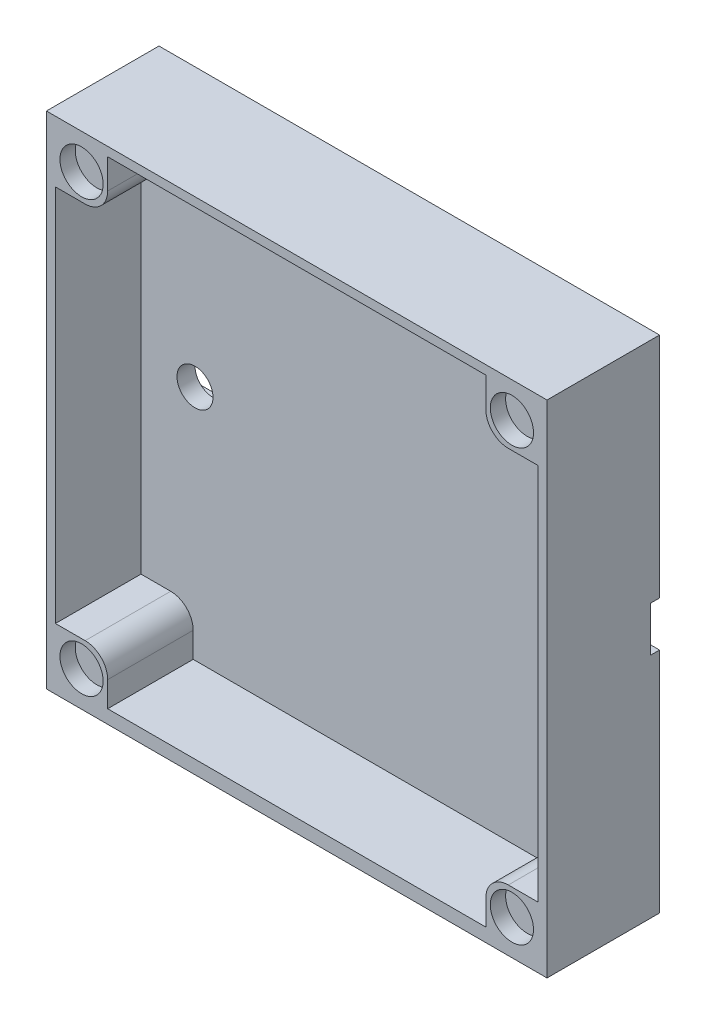
ISO-10303-21;
HEADER;
FILE_DESCRIPTION(('STEP AP214'),'2;1');
FILE_NAME('part.step','',(''),(''),'','','');
FILE_SCHEMA(('AUTOMOTIVE_DESIGN { 1 0 10303 214 1 1 1 1 }'));
ENDSEC;
DATA;
#1=APPLICATION_CONTEXT('core data for automotive mechanical design processes');
#2=APPLICATION_PROTOCOL_DEFINITION('international standard','automotive_design',2000,#1);
#3=PRODUCT_CONTEXT('',#1,'mechanical');
#4=PRODUCT('Part','Part','',(#3));
#5=PRODUCT_RELATED_PRODUCT_CATEGORY('part','',(#4));
#6=PRODUCT_DEFINITION_FORMATION('','',#4);
#7=PRODUCT_DEFINITION_CONTEXT('part definition',#1,'design');
#8=PRODUCT_DEFINITION('design','',#6,#7);
#9=PRODUCT_DEFINITION_SHAPE('','',#8);
#10=(LENGTH_UNIT() NAMED_UNIT(*) SI_UNIT(.MILLI.,.METRE.));
#11=(NAMED_UNIT(*) PLANE_ANGLE_UNIT() SI_UNIT($,.RADIAN.));
#12=(NAMED_UNIT(*) SI_UNIT($,.STERADIAN.) SOLID_ANGLE_UNIT());
#13=UNCERTAINTY_MEASURE_WITH_UNIT(LENGTH_MEASURE(1.E-05),#10,'distance_accuracy_value','');
#14=(GEOMETRIC_REPRESENTATION_CONTEXT(3) GLOBAL_UNCERTAINTY_ASSIGNED_CONTEXT((#13)) GLOBAL_UNIT_ASSIGNED_CONTEXT((#10,
#11,#12)) REPRESENTATION_CONTEXT('',''));
#15=CARTESIAN_POINT('',(0.,0.,0.));
#16=DIRECTION('',(0.,0.,1.));
#17=DIRECTION('',(1.,0.,0.));
#18=AXIS2_PLACEMENT_3D('',#15,#16,#17);
#19=CARTESIAN_POINT('',(27.8,27.8,3.));
#20=DIRECTION('',(1.,0.,0.));
#21=DIRECTION('',(0.,1.,0.));
#22=AXIS2_PLACEMENT_3D('',#19,#20,#21);
#23=PLANE('',#22);
#24=DIRECTION('',(0.,0.,-1.));
#25=VECTOR('',#24,1.);
#26=CARTESIAN_POINT('',(27.8,27.8,3.));
#27=LINE('',#26,#25);
#28=CARTESIAN_POINT('',(27.8,27.8,12.5));
#29=VERTEX_POINT('',#28);
#30=CARTESIAN_POINT('',(27.8,27.8,0.));
#31=VERTEX_POINT('',#30);
#32=EDGE_CURVE('E371',#29,#31,#27,.T.);
#33=ORIENTED_EDGE('',*,*,#32,.F.);
#34=DIRECTION('',(0.,1.,0.));
#35=VECTOR('',#34,1.);
#36=CARTESIAN_POINT('',(27.8,0.,12.5));
#37=LINE('',#36,#35);
#38=CARTESIAN_POINT('',(27.8,-27.8,12.5));
#39=VERTEX_POINT('',#38);
#40=EDGE_CURVE('E312',#39,#29,#37,.T.);
#41=ORIENTED_EDGE('',*,*,#40,.F.);
#42=DIRECTION('',(0.,0.,-1.));
#43=VECTOR('',#42,1.);
#44=CARTESIAN_POINT('',(27.8,-27.8,3.));
#45=LINE('',#44,#43);
#46=CARTESIAN_POINT('',(27.8,-27.8,0.));
#47=VERTEX_POINT('',#46);
#48=EDGE_CURVE('E367',#39,#47,#45,.T.);
#49=ORIENTED_EDGE('',*,*,#48,.T.);
#50=DIRECTION('',(0.,-1.,0.));
#51=VECTOR('',#50,1.);
#52=CARTESIAN_POINT('',(27.8,27.8,0.));
#53=LINE('',#52,#51);
#54=CARTESIAN_POINT('',(27.8,-2.5,0.));
#55=VERTEX_POINT('',#54);
#56=EDGE_CURVE('E363',#55,#47,#53,.T.);
#57=ORIENTED_EDGE('',*,*,#56,.F.);
#58=DIRECTION('',(0.,0.,-1.));
#59=VECTOR('',#58,1.);
#60=CARTESIAN_POINT('',(27.8,-2.5,1.));
#61=LINE('',#60,#59);
#62=CARTESIAN_POINT('',(27.8,-2.5,1.));
#63=VERTEX_POINT('',#62);
#64=EDGE_CURVE('E342',#63,#55,#61,.T.);
#65=ORIENTED_EDGE('',*,*,#64,.F.);
#66=DIRECTION('',(0.,-1.,0.));
#67=VECTOR('',#66,1.);
#68=CARTESIAN_POINT('',(27.8,2.5,1.));
#69=LINE('',#68,#67);
#70=CARTESIAN_POINT('',(27.8,2.5,1.));
#71=VERTEX_POINT('',#70);
#72=EDGE_CURVE('E330',#71,#63,#69,.T.);
#73=ORIENTED_EDGE('',*,*,#72,.F.);
#74=DIRECTION('',(0.,0.,-1.));
#75=VECTOR('',#74,1.);
#76=CARTESIAN_POINT('',(27.8,2.5,1.));
#77=LINE('',#76,#75);
#78=CARTESIAN_POINT('',(27.8,2.5,0.));
#79=VERTEX_POINT('',#78);
#80=EDGE_CURVE('E346',#71,#79,#77,.T.);
#81=ORIENTED_EDGE('',*,*,#80,.T.);
#82=EDGE_CURVE('E364',#31,#79,#53,.T.);
#83=ORIENTED_EDGE('',*,*,#82,.F.);
#84=EDGE_LOOP('',(#33,#41,#49,#57,#65,#73,#81,#83));
#85=FACE_BOUND('',#84,.T.);
#86=ADVANCED_FACE('F71',(#85),#23,.T.);
#87=CARTESIAN_POINT('',(-27.8,27.8,3.));
#88=DIRECTION('',(1.,0.,0.));
#89=DIRECTION('',(0.,1.,0.));
#90=AXIS2_PLACEMENT_3D('',#87,#88,#89);
#91=PLANE('',#90);
#92=DIRECTION('',(0.,-1.,0.));
#93=VECTOR('',#92,1.);
#94=CARTESIAN_POINT('',(-27.8,27.8,0.));
#95=LINE('',#94,#93);
#96=CARTESIAN_POINT('',(-27.8,-2.5,0.));
#97=VERTEX_POINT('',#96);
#98=CARTESIAN_POINT('',(-27.8,-27.8,0.));
#99=VERTEX_POINT('',#98);
#100=EDGE_CURVE('E358',#97,#99,#95,.T.);
#101=ORIENTED_EDGE('',*,*,#100,.T.);
#102=DIRECTION('',(0.,0.,-1.));
#103=VECTOR('',#102,1.);
#104=CARTESIAN_POINT('',(-27.8,-27.8,3.));
#105=LINE('',#104,#103);
#106=CARTESIAN_POINT('',(-27.8,-27.8,12.5));
#107=VERTEX_POINT('',#106);
#108=EDGE_CURVE('E366',#107,#99,#105,.T.);
#109=ORIENTED_EDGE('',*,*,#108,.F.);
#110=DIRECTION('',(0.,-1.,0.));
#111=VECTOR('',#110,1.);
#112=CARTESIAN_POINT('',(-27.8,0.,12.5));
#113=LINE('',#112,#111);
#114=CARTESIAN_POINT('',(-27.8,27.8,12.5));
#115=VERTEX_POINT('',#114);
#116=EDGE_CURVE('E316',#115,#107,#113,.T.);
#117=ORIENTED_EDGE('',*,*,#116,.F.);
#118=DIRECTION('',(0.,0.,-1.));
#119=VECTOR('',#118,1.);
#120=CARTESIAN_POINT('',(-27.8,27.8,3.));
#121=LINE('',#120,#119);
#122=CARTESIAN_POINT('',(-27.8,27.8,0.));
#123=VERTEX_POINT('',#122);
#124=EDGE_CURVE('E373',#115,#123,#121,.T.);
#125=ORIENTED_EDGE('',*,*,#124,.T.);
#126=CARTESIAN_POINT('',(-27.8,2.5,0.));
#127=VERTEX_POINT('',#126);
#128=EDGE_CURVE('E359',#123,#127,#95,.T.);
#129=ORIENTED_EDGE('',*,*,#128,.T.);
#130=DIRECTION('',(0.,0.,-1.));
#131=VECTOR('',#130,1.);
#132=CARTESIAN_POINT('',(-27.8,2.5,1.));
#133=LINE('',#132,#131);
#134=CARTESIAN_POINT('',(-27.8,2.5,1.));
#135=VERTEX_POINT('',#134);
#136=EDGE_CURVE('E350',#135,#127,#133,.T.);
#137=ORIENTED_EDGE('',*,*,#136,.F.);
#138=DIRECTION('',(0.,-1.,0.));
#139=VECTOR('',#138,1.);
#140=CARTESIAN_POINT('',(-27.8,2.5,1.));
#141=LINE('',#140,#139);
#142=CARTESIAN_POINT('',(-27.8,-2.5,1.));
#143=VERTEX_POINT('',#142);
#144=EDGE_CURVE('E337',#135,#143,#141,.T.);
#145=ORIENTED_EDGE('',*,*,#144,.T.);
#146=DIRECTION('',(0.,0.,-1.));
#147=VECTOR('',#146,1.);
#148=CARTESIAN_POINT('',(-27.8,-2.5,1.));
#149=LINE('',#148,#147);
#150=EDGE_CURVE('E353',#143,#97,#149,.T.);
#151=ORIENTED_EDGE('',*,*,#150,.T.);
#152=EDGE_LOOP('',(#101,#109,#117,#125,#129,#137,#145,#151));
#153=FACE_BOUND('',#152,.T.);
#154=ADVANCED_FACE('F494',(#153),#91,.F.);
#155=CARTESIAN_POINT('',(0.,0.,0.));
#156=DIRECTION('',(0.,0.,1.));
#157=DIRECTION('',(1.,0.,0.));
#158=AXIS2_PLACEMENT_3D('',#155,#156,#157);
#159=PLANE('',#158);
#160=DIRECTION('',(-1.,0.,0.));
#161=VECTOR('',#160,1.);
#162=CARTESIAN_POINT('',(27.8,2.5,0.));
#163=LINE('',#162,#161);
#164=EDGE_CURVE('E334',#79,#127,#163,.T.);
#165=ORIENTED_EDGE('',*,*,#164,.T.);
#166=ORIENTED_EDGE('',*,*,#128,.F.);
#167=DIRECTION('',(-1.,0.,0.));
#168=VECTOR('',#167,1.);
#169=CARTESIAN_POINT('',(27.8,27.8,0.));
#170=LINE('',#169,#168);
#171=EDGE_CURVE('E361',#31,#123,#170,.T.);
#172=ORIENTED_EDGE('',*,*,#171,.F.);
#173=ORIENTED_EDGE('',*,*,#82,.T.);
#174=EDGE_LOOP('',(#165,#166,#172,#173));
#175=FACE_BOUND('',#174,.T.);
#176=ADVANCED_FACE('F500',(#175),#159,.F.);
#177=CARTESIAN_POINT('',(27.8,-27.8,3.));
#178=DIRECTION('',(0.,-1.,0.));
#179=DIRECTION('',(1.,0.,0.));
#180=AXIS2_PLACEMENT_3D('',#177,#178,#179);
#181=PLANE('',#180);
#182=ORIENTED_EDGE('',*,*,#48,.F.);
#183=DIRECTION('',(1.,0.,0.));
#184=VECTOR('',#183,1.);
#185=CARTESIAN_POINT('',(0.,-27.8,12.5));
#186=LINE('',#185,#184);
#187=EDGE_CURVE('E310',#107,#39,#186,.T.);
#188=ORIENTED_EDGE('',*,*,#187,.F.);
#189=ORIENTED_EDGE('',*,*,#108,.T.);
#190=DIRECTION('',(-1.,0.,0.));
#191=VECTOR('',#190,1.);
#192=CARTESIAN_POINT('',(27.8,-27.8,0.));
#193=LINE('',#192,#191);
#194=EDGE_CURVE('E349',#47,#99,#193,.T.);
#195=ORIENTED_EDGE('',*,*,#194,.F.);
#196=EDGE_LOOP('',(#182,#188,#189,#195));
#197=FACE_BOUND('',#196,.T.);
#198=ADVANCED_FACE('F510',(#197),#181,.T.);
#199=CARTESIAN_POINT('',(27.8,27.8,3.));
#200=DIRECTION('',(0.,-1.,0.));
#201=DIRECTION('',(1.,0.,0.));
#202=AXIS2_PLACEMENT_3D('',#199,#200,#201);
#203=PLANE('',#202);
#204=ORIENTED_EDGE('',*,*,#171,.T.);
#205=ORIENTED_EDGE('',*,*,#124,.F.);
#206=DIRECTION('',(-1.,0.,0.));
#207=VECTOR('',#206,1.);
#208=CARTESIAN_POINT('',(0.,27.8,12.5));
#209=LINE('',#208,#207);
#210=EDGE_CURVE('E314',#29,#115,#209,.T.);
#211=ORIENTED_EDGE('',*,*,#210,.F.);
#212=ORIENTED_EDGE('',*,*,#32,.T.);
#213=EDGE_LOOP('',(#204,#205,#211,#212));
#214=FACE_BOUND('',#213,.T.);
#215=ADVANCED_FACE('F508',(#214),#203,.F.);
#216=ORIENTED_EDGE('',*,*,#194,.T.);
#217=ORIENTED_EDGE('',*,*,#100,.F.);
#218=DIRECTION('',(-1.,0.,0.));
#219=VECTOR('',#218,1.);
#220=CARTESIAN_POINT('',(27.8,-2.5,0.));
#221=LINE('',#220,#219);
#222=EDGE_CURVE('E319',#55,#97,#221,.T.);
#223=ORIENTED_EDGE('',*,*,#222,.F.);
#224=ORIENTED_EDGE('',*,*,#56,.T.);
#225=EDGE_LOOP('',(#216,#217,#223,#224));
#226=FACE_BOUND('',#225,.T.);
#227=ADVANCED_FACE('F506',(#226),#159,.F.);
#228=CARTESIAN_POINT('',(27.8,2.5,1.));
#229=DIRECTION('',(0.,-1.,0.));
#230=DIRECTION('',(0.,0.,-1.));
#231=AXIS2_PLACEMENT_3D('',#228,#229,#230);
#232=PLANE('',#231);
#233=ORIENTED_EDGE('',*,*,#164,.F.);
#234=ORIENTED_EDGE('',*,*,#80,.F.);
#235=DIRECTION('',(-1.,0.,0.));
#236=VECTOR('',#235,1.);
#237=CARTESIAN_POINT('',(27.8,2.5,1.));
#238=LINE('',#237,#236);
#239=EDGE_CURVE('E340',#71,#135,#238,.T.);
#240=ORIENTED_EDGE('',*,*,#239,.T.);
#241=ORIENTED_EDGE('',*,*,#136,.T.);
#242=EDGE_LOOP('',(#233,#234,#240,#241));
#243=FACE_BOUND('',#242,.T.);
#244=ADVANCED_FACE('F581',(#243),#232,.T.);
#245=CARTESIAN_POINT('',(27.8,-2.5,1.));
#246=DIRECTION('',(0.,-1.,0.));
#247=DIRECTION('',(0.,0.,-1.));
#248=AXIS2_PLACEMENT_3D('',#245,#246,#247);
#249=PLANE('',#248);
#250=ORIENTED_EDGE('',*,*,#222,.T.);
#251=ORIENTED_EDGE('',*,*,#150,.F.);
#252=DIRECTION('',(-1.,0.,0.));
#253=VECTOR('',#252,1.);
#254=CARTESIAN_POINT('',(27.8,-2.5,1.));
#255=LINE('',#254,#253);
#256=EDGE_CURVE('E333',#63,#143,#255,.T.);
#257=ORIENTED_EDGE('',*,*,#256,.F.);
#258=ORIENTED_EDGE('',*,*,#64,.T.);
#259=EDGE_LOOP('',(#250,#251,#257,#258));
#260=FACE_BOUND('',#259,.T.);
#261=ADVANCED_FACE('F576',(#260),#249,.F.);
#262=CARTESIAN_POINT('',(0.,0.,1.));
#263=DIRECTION('',(0.,0.,-1.));
#264=DIRECTION('',(-1.,0.,0.));
#265=AXIS2_PLACEMENT_3D('',#262,#263,#264);
#266=PLANE('',#265);
#267=CARTESIAN_POINT('',(20.8,0.,1.));
#268=DIRECTION('',(0.,0.,-1.));
#269=DIRECTION('',(-1.,0.,0.));
#270=AXIS2_PLACEMENT_3D('',#267,#268,#269);
#271=CIRCLE('',#270,2.);
#272=CARTESIAN_POINT('',(18.8,0.,1.));
#273=VERTEX_POINT('',#272);
#274=EDGE_CURVE('E299',#273,#273,#271,.T.);
#275=ORIENTED_EDGE('',*,*,#274,.F.);
#276=EDGE_LOOP('',(#275));
#277=FACE_BOUND('',#276,.T.);
#278=CARTESIAN_POINT('',(-20.8,0.,1.));
#279=DIRECTION('',(0.,0.,-1.));
#280=DIRECTION('',(-1.,0.,0.));
#281=AXIS2_PLACEMENT_3D('',#278,#279,#280);
#282=CIRCLE('',#281,2.);
#283=CARTESIAN_POINT('',(-22.8,0.,1.));
#284=VERTEX_POINT('',#283);
#285=EDGE_CURVE('E298',#284,#284,#282,.T.);
#286=ORIENTED_EDGE('',*,*,#285,.F.);
#287=EDGE_LOOP('',(#286));
#288=FACE_BOUND('',#287,.T.);
#289=ORIENTED_EDGE('',*,*,#72,.T.);
#290=ORIENTED_EDGE('',*,*,#256,.T.);
#291=ORIENTED_EDGE('',*,*,#144,.F.);
#292=ORIENTED_EDGE('',*,*,#239,.F.);
#293=EDGE_LOOP('',(#289,#290,#291,#292));
#294=FACE_BOUND('',#293,.T.);
#295=ADVANCED_FACE('F566',(#277,#288,#294),#266,.T.);
#296=CARTESIAN_POINT('',(26.8,0.,12.5));
#297=DIRECTION('',(1.,0.,0.));
#298=DIRECTION('',(0.,1.,0.));
#299=AXIS2_PLACEMENT_3D('',#296,#297,#298);
#300=PLANE('',#299);
#301=DIRECTION('',(0.,-1.,0.));
#302=VECTOR('',#301,1.);
#303=CARTESIAN_POINT('',(26.8,0.,3.));
#304=LINE('',#303,#302);
#305=CARTESIAN_POINT('',(26.8,21.,3.));
#306=VERTEX_POINT('',#305);
#307=CARTESIAN_POINT('',(26.8,-21.,3.));
#308=VERTEX_POINT('',#307);
#309=EDGE_CURVE('E252',#306,#308,#304,.T.);
#310=ORIENTED_EDGE('',*,*,#309,.T.);
#311=DIRECTION('',(0.,0.,1.));
#312=VECTOR('',#311,1.);
#313=CARTESIAN_POINT('',(26.8,-21.,12.5));
#314=LINE('',#313,#312);
#315=CARTESIAN_POINT('',(26.8,-21.,12.5));
#316=VERTEX_POINT('',#315);
#317=EDGE_CURVE('E274',#308,#316,#314,.T.);
#318=ORIENTED_EDGE('',*,*,#317,.T.);
#319=DIRECTION('',(0.,-1.,0.));
#320=VECTOR('',#319,1.);
#321=CARTESIAN_POINT('',(26.8,0.,12.5));
#322=LINE('',#321,#320);
#323=CARTESIAN_POINT('',(26.8,21.,12.5));
#324=VERTEX_POINT('',#323);
#325=EDGE_CURVE('E307',#324,#316,#322,.T.);
#326=ORIENTED_EDGE('',*,*,#325,.F.);
#327=DIRECTION('',(0.,0.,-1.));
#328=VECTOR('',#327,1.);
#329=CARTESIAN_POINT('',(26.8,21.,12.5));
#330=LINE('',#329,#328);
#331=EDGE_CURVE('E292',#324,#306,#330,.T.);
#332=ORIENTED_EDGE('',*,*,#331,.T.);
#333=EDGE_LOOP('',(#310,#318,#326,#332));
#334=FACE_BOUND('',#333,.T.);
#335=ADVANCED_FACE('F552',(#334),#300,.F.);
#336=CARTESIAN_POINT('',(-26.8,0.,12.5));
#337=DIRECTION('',(1.,0.,0.));
#338=DIRECTION('',(0.,1.,0.));
#339=AXIS2_PLACEMENT_3D('',#336,#337,#338);
#340=PLANE('',#339);
#341=DIRECTION('',(0.,0.,1.));
#342=VECTOR('',#341,1.);
#343=CARTESIAN_POINT('',(-26.8,-21.,12.5));
#344=LINE('',#343,#342);
#345=CARTESIAN_POINT('',(-26.8,-21.,3.));
#346=VERTEX_POINT('',#345);
#347=CARTESIAN_POINT('',(-26.8,-21.,12.5));
#348=VERTEX_POINT('',#347);
#349=EDGE_CURVE('E236',#346,#348,#344,.T.);
#350=ORIENTED_EDGE('',*,*,#349,.F.);
#351=DIRECTION('',(0.,-1.,0.));
#352=VECTOR('',#351,1.);
#353=CARTESIAN_POINT('',(-26.8,0.,3.));
#354=LINE('',#353,#352);
#355=CARTESIAN_POINT('',(-26.8,21.,3.));
#356=VERTEX_POINT('',#355);
#357=EDGE_CURVE('E244',#356,#346,#354,.T.);
#358=ORIENTED_EDGE('',*,*,#357,.F.);
#359=DIRECTION('',(0.,0.,-1.));
#360=VECTOR('',#359,1.);
#361=CARTESIAN_POINT('',(-26.8,21.,12.5));
#362=LINE('',#361,#360);
#363=CARTESIAN_POINT('',(-26.8,21.,12.5));
#364=VERTEX_POINT('',#363);
#365=EDGE_CURVE('E285',#364,#356,#362,.T.);
#366=ORIENTED_EDGE('',*,*,#365,.F.);
#367=DIRECTION('',(0.,-1.,0.));
#368=VECTOR('',#367,1.);
#369=CARTESIAN_POINT('',(-26.8,0.,12.5));
#370=LINE('',#369,#368);
#371=EDGE_CURVE('E256',#364,#348,#370,.T.);
#372=ORIENTED_EDGE('',*,*,#371,.T.);
#373=EDGE_LOOP('',(#350,#358,#366,#372));
#374=FACE_BOUND('',#373,.T.);
#375=ADVANCED_FACE('F254',(#374),#340,.T.);
#376=CARTESIAN_POINT('',(0.,26.8,12.5));
#377=DIRECTION('',(0.,1.,0.));
#378=DIRECTION('',(0.,0.,1.));
#379=AXIS2_PLACEMENT_3D('',#376,#377,#378);
#380=PLANE('',#379);
#381=DIRECTION('',(1.,0.,0.));
#382=VECTOR('',#381,1.);
#383=CARTESIAN_POINT('',(0.,26.8,12.5));
#384=LINE('',#383,#382);
#385=CARTESIAN_POINT('',(-21.,26.8,12.5));
#386=VERTEX_POINT('',#385);
#387=CARTESIAN_POINT('',(21.,26.8,12.5));
#388=VERTEX_POINT('',#387);
#389=EDGE_CURVE('E251',#386,#388,#384,.T.);
#390=ORIENTED_EDGE('',*,*,#389,.F.);
#391=DIRECTION('',(0.,0.,-1.));
#392=VECTOR('',#391,1.);
#393=CARTESIAN_POINT('',(-21.,26.8,12.5));
#394=LINE('',#393,#392);
#395=CARTESIAN_POINT('',(-21.,26.8,3.));
#396=VERTEX_POINT('',#395);
#397=EDGE_CURVE('E282',#386,#396,#394,.T.);
#398=ORIENTED_EDGE('',*,*,#397,.T.);
#399=DIRECTION('',(1.,0.,0.));
#400=VECTOR('',#399,1.);
#401=CARTESIAN_POINT('',(0.,26.8,3.));
#402=LINE('',#401,#400);
#403=CARTESIAN_POINT('',(21.,26.8,3.));
#404=VERTEX_POINT('',#403);
#405=EDGE_CURVE('E320',#396,#404,#402,.T.);
#406=ORIENTED_EDGE('',*,*,#405,.T.);
#407=DIRECTION('',(0.,0.,1.));
#408=VECTOR('',#407,1.);
#409=CARTESIAN_POINT('',(21.,26.8,12.5));
#410=LINE('',#409,#408);
#411=EDGE_CURVE('E295',#404,#388,#410,.T.);
#412=ORIENTED_EDGE('',*,*,#411,.T.);
#413=EDGE_LOOP('',(#390,#398,#406,#412));
#414=FACE_BOUND('',#413,.T.);
#415=ADVANCED_FACE('F475',(#414),#380,.F.);
#416=CARTESIAN_POINT('',(0.,0.,12.5));
#417=DIRECTION('',(0.,0.,1.));
#418=DIRECTION('',(1.,0.,0.));
#419=AXIS2_PLACEMENT_3D('',#416,#417,#418);
#420=PLANE('',#419);
#421=CARTESIAN_POINT('',(23.9002805646626,-23.9,12.5));
#422=DIRECTION('',(0.,0.,1.));
#423=DIRECTION('',(1.,0.,0.));
#424=AXIS2_PLACEMENT_3D('',#421,#422,#423);
#425=CIRCLE('',#424,2.4);
#426=CARTESIAN_POINT('',(26.3002805646626,-23.9,12.5));
#427=VERTEX_POINT('',#426);
#428=EDGE_CURVE('E445',#427,#427,#425,.T.);
#429=ORIENTED_EDGE('',*,*,#428,.F.);
#430=EDGE_LOOP('',(#429));
#431=FACE_BOUND('',#430,.T.);
#432=CARTESIAN_POINT('',(23.9002805646626,23.9,12.5));
#433=DIRECTION('',(0.,0.,1.));
#434=DIRECTION('',(1.,0.,0.));
#435=AXIS2_PLACEMENT_3D('',#432,#433,#434);
#436=CIRCLE('',#435,2.4);
#437=CARTESIAN_POINT('',(26.3002805646626,23.9,12.5));
#438=VERTEX_POINT('',#437);
#439=EDGE_CURVE('E451',#438,#438,#436,.T.);
#440=ORIENTED_EDGE('',*,*,#439,.F.);
#441=EDGE_LOOP('',(#440));
#442=FACE_BOUND('',#441,.T.);
#443=CARTESIAN_POINT('',(-23.9,23.9,12.5));
#444=DIRECTION('',(0.,0.,1.));
#445=DIRECTION('',(1.,0.,0.));
#446=AXIS2_PLACEMENT_3D('',#443,#444,#445);
#447=CIRCLE('',#446,2.4);
#448=CARTESIAN_POINT('',(-21.5,23.9,12.5));
#449=VERTEX_POINT('',#448);
#450=EDGE_CURVE('E457',#449,#449,#447,.T.);
#451=ORIENTED_EDGE('',*,*,#450,.F.);
#452=EDGE_LOOP('',(#451));
#453=FACE_BOUND('',#452,.T.);
#454=CARTESIAN_POINT('',(-23.9,-23.9,12.5));
#455=DIRECTION('',(0.,0.,1.));
#456=DIRECTION('',(1.,0.,0.));
#457=AXIS2_PLACEMENT_3D('',#454,#455,#456);
#458=CIRCLE('',#457,2.4);
#459=CARTESIAN_POINT('',(-21.5,-23.9,12.5));
#460=VERTEX_POINT('',#459);
#461=EDGE_CURVE('E439',#460,#460,#458,.T.);
#462=ORIENTED_EDGE('',*,*,#461,.F.);
#463=EDGE_LOOP('',(#462));
#464=FACE_BOUND('',#463,.T.);
#465=DIRECTION('',(0.,1.,0.));
#466=VECTOR('',#465,1.);
#467=CARTESIAN_POINT('',(21.,27.8,12.5));
#468=LINE('',#467,#466);
#469=CARTESIAN_POINT('',(21.,23.5,12.5));
#470=VERTEX_POINT('',#469);
#471=EDGE_CURVE('E290',#470,#388,#468,.T.);
#472=ORIENTED_EDGE('',*,*,#471,.F.);
#473=CARTESIAN_POINT('',(23.5,23.5,12.5));
#474=DIRECTION('',(0.,0.,1.));
#475=DIRECTION('',(1.,0.,0.));
#476=AXIS2_PLACEMENT_3D('',#473,#474,#475);
#477=CIRCLE('',#476,2.5);
#478=CARTESIAN_POINT('',(23.5,21.,12.5));
#479=VERTEX_POINT('',#478);
#480=EDGE_CURVE('E406',#470,#479,#477,.T.);
#481=ORIENTED_EDGE('',*,*,#480,.T.);
#482=DIRECTION('',(-1.,0.,0.));
#483=VECTOR('',#482,1.);
#484=CARTESIAN_POINT('',(27.8,21.,12.5));
#485=LINE('',#484,#483);
#486=EDGE_CURVE('E287',#324,#479,#485,.T.);
#487=ORIENTED_EDGE('',*,*,#486,.F.);
#488=ORIENTED_EDGE('',*,*,#325,.T.);
#489=DIRECTION('',(1.,0.,0.));
#490=VECTOR('',#489,1.);
#491=CARTESIAN_POINT('',(27.8,-21.,12.5));
#492=LINE('',#491,#490);
#493=CARTESIAN_POINT('',(23.5,-21.,12.5));
#494=VERTEX_POINT('',#493);
#495=EDGE_CURVE('E269',#494,#316,#492,.T.);
#496=ORIENTED_EDGE('',*,*,#495,.F.);
#497=CARTESIAN_POINT('',(23.5,-23.5,12.5));
#498=DIRECTION('',(0.,0.,1.));
#499=DIRECTION('',(1.,0.,0.));
#500=AXIS2_PLACEMENT_3D('',#497,#498,#499);
#501=CIRCLE('',#500,2.5);
#502=CARTESIAN_POINT('',(21.,-23.5,12.5));
#503=VERTEX_POINT('',#502);
#504=EDGE_CURVE('E404',#494,#503,#501,.T.);
#505=ORIENTED_EDGE('',*,*,#504,.T.);
#506=DIRECTION('',(0.,1.,0.));
#507=VECTOR('',#506,1.);
#508=CARTESIAN_POINT('',(21.,-27.8,12.5));
#509=LINE('',#508,#507);
#510=CARTESIAN_POINT('',(21.,-26.3,12.5));
#511=VERTEX_POINT('',#510);
#512=EDGE_CURVE('E261',#511,#503,#509,.T.);
#513=ORIENTED_EDGE('',*,*,#512,.F.);
#514=DIRECTION('',(1.,0.,0.));
#515=VECTOR('',#514,1.);
#516=CARTESIAN_POINT('',(-26.8,-26.3,12.5));
#517=LINE('',#516,#515);
#518=CARTESIAN_POINT('',(-21.,-26.3,12.5));
#519=VERTEX_POINT('',#518);
#520=EDGE_CURVE('E322',#519,#511,#517,.T.);
#521=ORIENTED_EDGE('',*,*,#520,.F.);
#522=DIRECTION('',(0.,-1.,0.));
#523=VECTOR('',#522,1.);
#524=CARTESIAN_POINT('',(-21.,-27.8,12.5));
#525=LINE('',#524,#523);
#526=CARTESIAN_POINT('',(-21.,-23.5,12.5));
#527=VERTEX_POINT('',#526);
#528=EDGE_CURVE('E258',#527,#519,#525,.T.);
#529=ORIENTED_EDGE('',*,*,#528,.F.);
#530=CARTESIAN_POINT('',(-23.5,-23.5,12.5));
#531=DIRECTION('',(0.,0.,1.));
#532=DIRECTION('',(1.,0.,0.));
#533=AXIS2_PLACEMENT_3D('',#530,#531,#532);
#534=CIRCLE('',#533,2.5);
#535=CARTESIAN_POINT('',(-23.5,-21.,12.5));
#536=VERTEX_POINT('',#535);
#537=EDGE_CURVE('E402',#527,#536,#534,.T.);
#538=ORIENTED_EDGE('',*,*,#537,.T.);
#539=DIRECTION('',(1.,0.,0.));
#540=VECTOR('',#539,1.);
#541=CARTESIAN_POINT('',(-27.8,-21.,12.5));
#542=LINE('',#541,#540);
#543=EDGE_CURVE('E263',#348,#536,#542,.T.);
#544=ORIENTED_EDGE('',*,*,#543,.F.);
#545=ORIENTED_EDGE('',*,*,#371,.F.);
#546=DIRECTION('',(-1.,0.,0.));
#547=VECTOR('',#546,1.);
#548=CARTESIAN_POINT('',(-27.8,21.,12.5));
#549=LINE('',#548,#547);
#550=CARTESIAN_POINT('',(-23.5,21.,12.5));
#551=VERTEX_POINT('',#550);
#552=EDGE_CURVE('E280',#551,#364,#549,.T.);
#553=ORIENTED_EDGE('',*,*,#552,.F.);
#554=CARTESIAN_POINT('',(-23.5,23.5,12.5));
#555=DIRECTION('',(0.,0.,1.));
#556=DIRECTION('',(1.,0.,0.));
#557=AXIS2_PLACEMENT_3D('',#554,#555,#556);
#558=CIRCLE('',#557,2.5);
#559=CARTESIAN_POINT('',(-21.,23.5,12.5));
#560=VERTEX_POINT('',#559);
#561=EDGE_CURVE('E400',#551,#560,#558,.T.);
#562=ORIENTED_EDGE('',*,*,#561,.T.);
#563=DIRECTION('',(0.,-1.,0.));
#564=VECTOR('',#563,1.);
#565=CARTESIAN_POINT('',(-21.,27.8,12.5));
#566=LINE('',#565,#564);
#567=EDGE_CURVE('E277',#386,#560,#566,.T.);
#568=ORIENTED_EDGE('',*,*,#567,.F.);
#569=ORIENTED_EDGE('',*,*,#389,.T.);
#570=EDGE_LOOP('',(#472,#481,#487,#488,#496,#505,#513,#521,#529,#538,#544,#545,#553,#562,#568,#569));
#571=FACE_BOUND('',#570,.T.);
#572=ORIENTED_EDGE('',*,*,#187,.T.);
#573=ORIENTED_EDGE('',*,*,#40,.T.);
#574=ORIENTED_EDGE('',*,*,#210,.T.);
#575=ORIENTED_EDGE('',*,*,#116,.T.);
#576=EDGE_LOOP('',(#572,#573,#574,#575));
#577=FACE_BOUND('',#576,.T.);
#578=ADVANCED_FACE('F434',(#431,#442,#453,#464,#571,#577),#420,.T.);
#579=CARTESIAN_POINT('',(-26.8,-26.3,12.5));
#580=DIRECTION('',(0.,1.,0.));
#581=DIRECTION('',(0.,0.,1.));
#582=AXIS2_PLACEMENT_3D('',#579,#580,#581);
#583=PLANE('',#582);
#584=DIRECTION('',(0.,0.,-1.));
#585=VECTOR('',#584,1.);
#586=CARTESIAN_POINT('',(-21.,-26.3,12.5));
#587=LINE('',#586,#585);
#588=CARTESIAN_POINT('',(-21.,-26.3,3.));
#589=VERTEX_POINT('',#588);
#590=EDGE_CURVE('E257',#519,#589,#587,.T.);
#591=ORIENTED_EDGE('',*,*,#590,.F.);
#592=ORIENTED_EDGE('',*,*,#520,.T.);
#593=DIRECTION('',(0.,0.,1.));
#594=VECTOR('',#593,1.);
#595=CARTESIAN_POINT('',(21.,-26.3,12.5));
#596=LINE('',#595,#594);
#597=CARTESIAN_POINT('',(21.,-26.3,3.));
#598=VERTEX_POINT('',#597);
#599=EDGE_CURVE('E271',#598,#511,#596,.T.);
#600=ORIENTED_EDGE('',*,*,#599,.F.);
#601=DIRECTION('',(1.,0.,0.));
#602=VECTOR('',#601,1.);
#603=CARTESIAN_POINT('',(-26.8,-26.3,3.));
#604=LINE('',#603,#602);
#605=EDGE_CURVE('E326',#589,#598,#604,.T.);
#606=ORIENTED_EDGE('',*,*,#605,.F.);
#607=EDGE_LOOP('',(#591,#592,#600,#606));
#608=FACE_BOUND('',#607,.T.);
#609=ADVANCED_FACE('F474',(#608),#583,.T.);
#610=CARTESIAN_POINT('',(0.,0.,3.));
#611=DIRECTION('',(0.,0.,1.));
#612=DIRECTION('',(1.,0.,0.));
#613=AXIS2_PLACEMENT_3D('',#610,#611,#612);
#614=PLANE('',#613);
#615=DIRECTION('',(0.,1.,0.));
#616=VECTOR('',#615,1.);
#617=CARTESIAN_POINT('',(-21.,0.,3.));
#618=LINE('',#617,#616);
#619=CARTESIAN_POINT('',(-21.,-23.5,3.));
#620=VERTEX_POINT('',#619);
#621=EDGE_CURVE('E240',#589,#620,#618,.T.);
#622=ORIENTED_EDGE('',*,*,#621,.F.);
#623=ORIENTED_EDGE('',*,*,#605,.T.);
#624=DIRECTION('',(0.,-1.,0.));
#625=VECTOR('',#624,1.);
#626=CARTESIAN_POINT('',(21.,0.,3.));
#627=LINE('',#626,#625);
#628=CARTESIAN_POINT('',(21.,-23.5,3.));
#629=VERTEX_POINT('',#628);
#630=EDGE_CURVE('E389',#629,#598,#627,.T.);
#631=ORIENTED_EDGE('',*,*,#630,.F.);
#632=CARTESIAN_POINT('',(23.5,-23.5,3.));
#633=DIRECTION('',(0.,0.,1.));
#634=DIRECTION('',(1.,0.,0.));
#635=AXIS2_PLACEMENT_3D('',#632,#633,#634);
#636=CIRCLE('',#635,2.5);
#637=CARTESIAN_POINT('',(23.5,-21.,3.));
#638=VERTEX_POINT('',#637);
#639=EDGE_CURVE('E422',#629,#638,#636,.F.);
#640=ORIENTED_EDGE('',*,*,#639,.T.);
#641=DIRECTION('',(-1.,0.,0.));
#642=VECTOR('',#641,1.);
#643=CARTESIAN_POINT('',(0.,-21.,3.));
#644=LINE('',#643,#642);
#645=EDGE_CURVE('E241',#308,#638,#644,.T.);
#646=ORIENTED_EDGE('',*,*,#645,.F.);
#647=ORIENTED_EDGE('',*,*,#309,.F.);
#648=DIRECTION('',(1.,0.,0.));
#649=VECTOR('',#648,1.);
#650=CARTESIAN_POINT('',(0.,21.,3.));
#651=LINE('',#650,#649);
#652=CARTESIAN_POINT('',(23.5,21.,3.));
#653=VERTEX_POINT('',#652);
#654=EDGE_CURVE('E370',#653,#306,#651,.T.);
#655=ORIENTED_EDGE('',*,*,#654,.F.);
#656=CARTESIAN_POINT('',(23.5,23.5,3.));
#657=DIRECTION('',(0.,0.,1.));
#658=DIRECTION('',(1.,0.,0.));
#659=AXIS2_PLACEMENT_3D('',#656,#657,#658);
#660=CIRCLE('',#659,2.5);
#661=CARTESIAN_POINT('',(21.,23.5,3.));
#662=VERTEX_POINT('',#661);
#663=EDGE_CURVE('E420',#653,#662,#660,.F.);
#664=ORIENTED_EDGE('',*,*,#663,.T.);
#665=DIRECTION('',(0.,-1.,0.));
#666=VECTOR('',#665,1.);
#667=CARTESIAN_POINT('',(21.,0.,3.));
#668=LINE('',#667,#666);
#669=EDGE_CURVE('E383',#404,#662,#668,.T.);
#670=ORIENTED_EDGE('',*,*,#669,.F.);
#671=ORIENTED_EDGE('',*,*,#405,.F.);
#672=DIRECTION('',(0.,1.,0.));
#673=VECTOR('',#672,1.);
#674=CARTESIAN_POINT('',(-21.,0.,3.));
#675=LINE('',#674,#673);
#676=CARTESIAN_POINT('',(-21.,23.5,3.));
#677=VERTEX_POINT('',#676);
#678=EDGE_CURVE('E386',#677,#396,#675,.T.);
#679=ORIENTED_EDGE('',*,*,#678,.F.);
#680=CARTESIAN_POINT('',(-23.5,23.5,3.));
#681=DIRECTION('',(0.,0.,1.));
#682=DIRECTION('',(1.,0.,0.));
#683=AXIS2_PLACEMENT_3D('',#680,#681,#682);
#684=CIRCLE('',#683,2.5);
#685=CARTESIAN_POINT('',(-23.5,21.,3.));
#686=VERTEX_POINT('',#685);
#687=EDGE_CURVE('E12',#677,#686,#684,.F.);
#688=ORIENTED_EDGE('',*,*,#687,.T.);
#689=DIRECTION('',(1.,0.,0.));
#690=VECTOR('',#689,1.);
#691=CARTESIAN_POINT('',(0.,21.,3.));
#692=LINE('',#691,#690);
#693=EDGE_CURVE('E247',#356,#686,#692,.T.);
#694=ORIENTED_EDGE('',*,*,#693,.F.);
#695=ORIENTED_EDGE('',*,*,#357,.T.);
#696=DIRECTION('',(-1.,0.,0.));
#697=VECTOR('',#696,1.);
#698=CARTESIAN_POINT('',(0.,-21.,3.));
#699=LINE('',#698,#697);
#700=CARTESIAN_POINT('',(-23.5,-21.,3.));
#701=VERTEX_POINT('',#700);
#702=EDGE_CURVE('E231',#701,#346,#699,.T.);
#703=ORIENTED_EDGE('',*,*,#702,.F.);
#704=CARTESIAN_POINT('',(-23.5,-23.5,3.));
#705=DIRECTION('',(0.,0.,1.));
#706=DIRECTION('',(1.,0.,0.));
#707=AXIS2_PLACEMENT_3D('',#704,#705,#706);
#708=CIRCLE('',#707,2.5);
#709=EDGE_CURVE('E79',#701,#620,#708,.F.);
#710=ORIENTED_EDGE('',*,*,#709,.T.);
#711=EDGE_LOOP('',(#622,#623,#631,#640,#646,#647,#655,#664,#670,#671,#679,#688,#694,#695,#703,#710));
#712=FACE_BOUND('',#711,.T.);
#713=CARTESIAN_POINT('',(20.8,0.,3.));
#714=DIRECTION('',(0.,0.,1.));
#715=DIRECTION('',(1.,0.,0.));
#716=AXIS2_PLACEMENT_3D('',#713,#714,#715);
#717=CIRCLE('',#716,2.);
#718=CARTESIAN_POINT('',(22.8,0.,3.));
#719=VERTEX_POINT('',#718);
#720=EDGE_CURVE('E329',#719,#719,#717,.T.);
#721=ORIENTED_EDGE('',*,*,#720,.F.);
#722=EDGE_LOOP('',(#721));
#723=FACE_BOUND('',#722,.T.);
#724=CARTESIAN_POINT('',(-20.8,0.,3.));
#725=DIRECTION('',(0.,0.,1.));
#726=DIRECTION('',(1.,0.,0.));
#727=AXIS2_PLACEMENT_3D('',#724,#725,#726);
#728=CIRCLE('',#727,2.);
#729=CARTESIAN_POINT('',(-18.8,0.,3.));
#730=VERTEX_POINT('',#729);
#731=EDGE_CURVE('E302',#730,#730,#728,.T.);
#732=ORIENTED_EDGE('',*,*,#731,.F.);
#733=EDGE_LOOP('',(#732));
#734=FACE_BOUND('',#733,.T.);
#735=ADVANCED_FACE('F245',(#712,#723,#734),#614,.T.);
#736=CARTESIAN_POINT('',(-20.8,0.,5.));
#737=DIRECTION('',(0.,0.,-1.));
#738=DIRECTION('',(-1.,0.,0.));
#739=AXIS2_PLACEMENT_3D('',#736,#737,#738);
#740=CYLINDRICAL_SURFACE('',#739,2.);
#741=ORIENTED_EDGE('',*,*,#731,.T.);
#742=EDGE_LOOP('',(#741));
#743=FACE_BOUND('',#742,.T.);
#744=ORIENTED_EDGE('',*,*,#285,.T.);
#745=EDGE_LOOP('',(#744));
#746=FACE_BOUND('',#745,.T.);
#747=ADVANCED_FACE('F570',(#743,#746),#740,.F.);
#748=CARTESIAN_POINT('',(20.8,0.,5.));
#749=DIRECTION('',(0.,0.,-1.));
#750=DIRECTION('',(-1.,0.,0.));
#751=AXIS2_PLACEMENT_3D('',#748,#749,#750);
#752=CYLINDRICAL_SURFACE('',#751,2.);
#753=ORIENTED_EDGE('',*,*,#720,.T.);
#754=EDGE_LOOP('',(#753));
#755=FACE_BOUND('',#754,.T.);
#756=ORIENTED_EDGE('',*,*,#274,.T.);
#757=EDGE_LOOP('',(#756));
#758=FACE_BOUND('',#757,.T.);
#759=ADVANCED_FACE('F756',(#755,#758),#752,.F.);
#760=CARTESIAN_POINT('',(21.,27.8,12.5));
#761=DIRECTION('',(-1.,0.,0.));
#762=DIRECTION('',(0.,0.,1.));
#763=AXIS2_PLACEMENT_3D('',#760,#761,#762);
#764=PLANE('',#763);
#765=ORIENTED_EDGE('',*,*,#669,.T.);
#766=DIRECTION('',(0.,0.,-1.));
#767=VECTOR('',#766,1.);
#768=CARTESIAN_POINT('',(21.,23.5,12.5));
#769=LINE('',#768,#767);
#770=EDGE_CURVE('E398',#662,#470,#769,.F.);
#771=ORIENTED_EDGE('',*,*,#770,.T.);
#772=ORIENTED_EDGE('',*,*,#471,.T.);
#773=ORIENTED_EDGE('',*,*,#411,.F.);
#774=EDGE_LOOP('',(#765,#771,#772,#773));
#775=FACE_BOUND('',#774,.T.);
#776=ADVANCED_FACE('F752',(#775),#764,.T.);
#777=CARTESIAN_POINT('',(27.8,21.,12.5));
#778=DIRECTION('',(0.,-1.,0.));
#779=DIRECTION('',(0.,0.,-1.));
#780=AXIS2_PLACEMENT_3D('',#777,#778,#779);
#781=PLANE('',#780);
#782=ORIENTED_EDGE('',*,*,#486,.T.);
#783=DIRECTION('',(0.,0.,-1.));
#784=VECTOR('',#783,1.);
#785=CARTESIAN_POINT('',(23.5,21.,12.5));
#786=LINE('',#785,#784);
#787=EDGE_CURVE('E395',#479,#653,#786,.T.);
#788=ORIENTED_EDGE('',*,*,#787,.T.);
#789=ORIENTED_EDGE('',*,*,#654,.T.);
#790=ORIENTED_EDGE('',*,*,#331,.F.);
#791=EDGE_LOOP('',(#782,#788,#789,#790));
#792=FACE_BOUND('',#791,.T.);
#793=ADVANCED_FACE('F547',(#792),#781,.T.);
#794=CARTESIAN_POINT('',(-21.,27.8,12.5));
#795=DIRECTION('',(1.,0.,0.));
#796=DIRECTION('',(0.,0.,-1.));
#797=AXIS2_PLACEMENT_3D('',#794,#795,#796);
#798=PLANE('',#797);
#799=ORIENTED_EDGE('',*,*,#567,.T.);
#800=DIRECTION('',(0.,0.,-1.));
#801=VECTOR('',#800,1.);
#802=CARTESIAN_POINT('',(-21.,23.5,12.5));
#803=LINE('',#802,#801);
#804=EDGE_CURVE('E416',#560,#677,#803,.T.);
#805=ORIENTED_EDGE('',*,*,#804,.T.);
#806=ORIENTED_EDGE('',*,*,#678,.T.);
#807=ORIENTED_EDGE('',*,*,#397,.F.);
#808=EDGE_LOOP('',(#799,#805,#806,#807));
#809=FACE_BOUND('',#808,.T.);
#810=ADVANCED_FACE('F535',(#809),#798,.T.);
#811=CARTESIAN_POINT('',(-27.8,21.,12.5));
#812=DIRECTION('',(0.,-1.,0.));
#813=DIRECTION('',(0.,0.,-1.));
#814=AXIS2_PLACEMENT_3D('',#811,#812,#813);
#815=PLANE('',#814);
#816=ORIENTED_EDGE('',*,*,#693,.T.);
#817=DIRECTION('',(0.,0.,-1.));
#818=VECTOR('',#817,1.);
#819=CARTESIAN_POINT('',(-23.5,21.,12.5));
#820=LINE('',#819,#818);
#821=EDGE_CURVE('E418',#686,#551,#820,.F.);
#822=ORIENTED_EDGE('',*,*,#821,.T.);
#823=ORIENTED_EDGE('',*,*,#552,.T.);
#824=ORIENTED_EDGE('',*,*,#365,.T.);
#825=EDGE_LOOP('',(#816,#822,#823,#824));
#826=FACE_BOUND('',#825,.T.);
#827=ADVANCED_FACE('F774',(#826),#815,.T.);
#828=CARTESIAN_POINT('',(27.8,-21.,12.5));
#829=DIRECTION('',(0.,1.,0.));
#830=DIRECTION('',(0.,0.,1.));
#831=AXIS2_PLACEMENT_3D('',#828,#829,#830);
#832=PLANE('',#831);
#833=ORIENTED_EDGE('',*,*,#645,.T.);
#834=DIRECTION('',(0.,0.,-1.));
#835=VECTOR('',#834,1.);
#836=CARTESIAN_POINT('',(23.5,-21.,12.5));
#837=LINE('',#836,#835);
#838=EDGE_CURVE('E411',#638,#494,#837,.F.);
#839=ORIENTED_EDGE('',*,*,#838,.T.);
#840=ORIENTED_EDGE('',*,*,#495,.T.);
#841=ORIENTED_EDGE('',*,*,#317,.F.);
#842=EDGE_LOOP('',(#833,#839,#840,#841));
#843=FACE_BOUND('',#842,.T.);
#844=ADVANCED_FACE('F783',(#843),#832,.T.);
#845=CARTESIAN_POINT('',(21.,-27.8,12.5));
#846=DIRECTION('',(-1.,0.,0.));
#847=DIRECTION('',(0.,0.,1.));
#848=AXIS2_PLACEMENT_3D('',#845,#846,#847);
#849=PLANE('',#848);
#850=ORIENTED_EDGE('',*,*,#512,.T.);
#851=DIRECTION('',(0.,0.,-1.));
#852=VECTOR('',#851,1.);
#853=CARTESIAN_POINT('',(21.,-23.5,12.5));
#854=LINE('',#853,#852);
#855=EDGE_CURVE('E408',#503,#629,#854,.T.);
#856=ORIENTED_EDGE('',*,*,#855,.T.);
#857=ORIENTED_EDGE('',*,*,#630,.T.);
#858=ORIENTED_EDGE('',*,*,#599,.T.);
#859=EDGE_LOOP('',(#850,#856,#857,#858));
#860=FACE_BOUND('',#859,.T.);
#861=ADVANCED_FACE('F561',(#860),#849,.T.);
#862=CARTESIAN_POINT('',(-21.,-27.8,12.5));
#863=DIRECTION('',(1.,0.,0.));
#864=DIRECTION('',(0.,0.,-1.));
#865=AXIS2_PLACEMENT_3D('',#862,#863,#864);
#866=PLANE('',#865);
#867=ORIENTED_EDGE('',*,*,#621,.T.);
#868=DIRECTION('',(0.,0.,-1.));
#869=VECTOR('',#868,1.);
#870=CARTESIAN_POINT('',(-21.,-23.5,12.5));
#871=LINE('',#870,#869);
#872=EDGE_CURVE('E414',#620,#527,#871,.F.);
#873=ORIENTED_EDGE('',*,*,#872,.T.);
#874=ORIENTED_EDGE('',*,*,#528,.T.);
#875=ORIENTED_EDGE('',*,*,#590,.T.);
#876=EDGE_LOOP('',(#867,#873,#874,#875));
#877=FACE_BOUND('',#876,.T.);
#878=ADVANCED_FACE('F427',(#877),#866,.T.);
#879=CARTESIAN_POINT('',(-27.8,-21.,12.5));
#880=DIRECTION('',(0.,1.,0.));
#881=DIRECTION('',(0.,0.,1.));
#882=AXIS2_PLACEMENT_3D('',#879,#880,#881);
#883=PLANE('',#882);
#884=ORIENTED_EDGE('',*,*,#543,.T.);
#885=DIRECTION('',(0.,0.,-1.));
#886=VECTOR('',#885,1.);
#887=CARTESIAN_POINT('',(-23.5,-21.,12.5));
#888=LINE('',#887,#886);
#889=EDGE_CURVE('E239',#536,#701,#888,.T.);
#890=ORIENTED_EDGE('',*,*,#889,.T.);
#891=ORIENTED_EDGE('',*,*,#702,.T.);
#892=ORIENTED_EDGE('',*,*,#349,.T.);
#893=EDGE_LOOP('',(#884,#890,#891,#892));
#894=FACE_BOUND('',#893,.T.);
#895=ADVANCED_FACE('F234',(#894),#883,.T.);
#896=CARTESIAN_POINT('',(-23.9,-23.9,10.8));
#897=DIRECTION('',(0.,0.,1.));
#898=DIRECTION('',(1.,0.,0.));
#899=AXIS2_PLACEMENT_3D('',#896,#897,#898);
#900=CYLINDRICAL_SURFACE('',#899,2.4);
#901=CARTESIAN_POINT('',(-23.9,-23.9,10.8));
#902=DIRECTION('',(0.,0.,1.));
#903=DIRECTION('',(1.,0.,0.));
#904=AXIS2_PLACEMENT_3D('',#901,#902,#903);
#905=CIRCLE('',#904,2.4);
#906=CARTESIAN_POINT('',(-21.5,-23.9,10.8));
#907=VERTEX_POINT('',#906);
#908=EDGE_CURVE('E437',#907,#907,#905,.T.);
#909=ORIENTED_EDGE('',*,*,#908,.F.);
#910=EDGE_LOOP('',(#909));
#911=FACE_BOUND('',#910,.T.);
#912=ORIENTED_EDGE('',*,*,#461,.T.);
#913=EDGE_LOOP('',(#912));
#914=FACE_BOUND('',#913,.T.);
#915=ADVANCED_FACE('F480',(#911,#914),#900,.F.);
#916=CARTESIAN_POINT('',(-23.9,-23.9,10.8));
#917=DIRECTION('',(0.,0.,1.));
#918=DIRECTION('',(1.,0.,0.));
#919=AXIS2_PLACEMENT_3D('',#916,#917,#918);
#920=PLANE('',#919);
#921=ORIENTED_EDGE('',*,*,#908,.T.);
#922=EDGE_LOOP('',(#921));
#923=FACE_BOUND('',#922,.T.);
#924=ADVANCED_FACE('F468',(#923),#920,.T.);
#925=CARTESIAN_POINT('',(-23.9,23.9,10.8));
#926=DIRECTION('',(0.,0.,1.));
#927=DIRECTION('',(1.,0.,0.));
#928=AXIS2_PLACEMENT_3D('',#925,#926,#927);
#929=CYLINDRICAL_SURFACE('',#928,2.4);
#930=CARTESIAN_POINT('',(-23.9,23.9,10.8));
#931=DIRECTION('',(0.,0.,1.));
#932=DIRECTION('',(1.,0.,0.));
#933=AXIS2_PLACEMENT_3D('',#930,#931,#932);
#934=CIRCLE('',#933,2.4);
#935=CARTESIAN_POINT('',(-21.5,23.9,10.8));
#936=VERTEX_POINT('',#935);
#937=EDGE_CURVE('E443',#936,#936,#934,.T.);
#938=ORIENTED_EDGE('',*,*,#937,.F.);
#939=EDGE_LOOP('',(#938));
#940=FACE_BOUND('',#939,.T.);
#941=ORIENTED_EDGE('',*,*,#450,.T.);
#942=EDGE_LOOP('',(#941));
#943=FACE_BOUND('',#942,.T.);
#944=ADVANCED_FACE('F465',(#940,#943),#929,.F.);
#945=CARTESIAN_POINT('',(-23.9,23.9,10.8));
#946=DIRECTION('',(0.,0.,1.));
#947=DIRECTION('',(1.,0.,0.));
#948=AXIS2_PLACEMENT_3D('',#945,#946,#947);
#949=PLANE('',#948);
#950=ORIENTED_EDGE('',*,*,#937,.T.);
#951=EDGE_LOOP('',(#950));
#952=FACE_BOUND('',#951,.T.);
#953=ADVANCED_FACE('F463',(#952),#949,.T.);
#954=CARTESIAN_POINT('',(23.9002805646626,23.9,10.8));
#955=DIRECTION('',(0.,0.,1.));
#956=DIRECTION('',(1.,0.,0.));
#957=AXIS2_PLACEMENT_3D('',#954,#955,#956);
#958=CYLINDRICAL_SURFACE('',#957,2.4);
#959=CARTESIAN_POINT('',(23.9002805646626,23.9,10.8));
#960=DIRECTION('',(0.,0.,1.));
#961=DIRECTION('',(1.,0.,0.));
#962=AXIS2_PLACEMENT_3D('',#959,#960,#961);
#963=CIRCLE('',#962,2.4);
#964=CARTESIAN_POINT('',(26.3002805646626,23.9,10.8));
#965=VERTEX_POINT('',#964);
#966=EDGE_CURVE('E454',#965,#965,#963,.T.);
#967=ORIENTED_EDGE('',*,*,#966,.F.);
#968=EDGE_LOOP('',(#967));
#969=FACE_BOUND('',#968,.T.);
#970=ORIENTED_EDGE('',*,*,#439,.T.);
#971=EDGE_LOOP('',(#970));
#972=FACE_BOUND('',#971,.T.);
#973=ADVANCED_FACE('F691',(#969,#972),#958,.F.);
#974=CARTESIAN_POINT('',(23.9002805646626,23.9,10.8));
#975=DIRECTION('',(0.,0.,1.));
#976=DIRECTION('',(1.,0.,0.));
#977=AXIS2_PLACEMENT_3D('',#974,#975,#976);
#978=PLANE('',#977);
#979=ORIENTED_EDGE('',*,*,#966,.T.);
#980=EDGE_LOOP('',(#979));
#981=FACE_BOUND('',#980,.T.);
#982=ADVANCED_FACE('F700',(#981),#978,.T.);
#983=CARTESIAN_POINT('',(23.9002805646626,-23.9,10.8));
#984=DIRECTION('',(0.,0.,1.));
#985=DIRECTION('',(1.,0.,0.));
#986=AXIS2_PLACEMENT_3D('',#983,#984,#985);
#987=CYLINDRICAL_SURFACE('',#986,2.4);
#988=CARTESIAN_POINT('',(23.9002805646626,-23.9,10.8));
#989=DIRECTION('',(0.,0.,1.));
#990=DIRECTION('',(1.,0.,0.));
#991=AXIS2_PLACEMENT_3D('',#988,#989,#990);
#992=CIRCLE('',#991,2.4);
#993=CARTESIAN_POINT('',(26.3002805646626,-23.9,10.8));
#994=VERTEX_POINT('',#993);
#995=EDGE_CURVE('E448',#994,#994,#992,.T.);
#996=ORIENTED_EDGE('',*,*,#995,.F.);
#997=EDGE_LOOP('',(#996));
#998=FACE_BOUND('',#997,.T.);
#999=ORIENTED_EDGE('',*,*,#428,.T.);
#1000=EDGE_LOOP('',(#999));
#1001=FACE_BOUND('',#1000,.T.);
#1002=ADVANCED_FACE('F710',(#998,#1001),#987,.F.);
#1003=CARTESIAN_POINT('',(23.9002805646626,-23.9,10.8));
#1004=DIRECTION('',(0.,0.,1.));
#1005=DIRECTION('',(1.,0.,0.));
#1006=AXIS2_PLACEMENT_3D('',#1003,#1004,#1005);
#1007=PLANE('',#1006);
#1008=ORIENTED_EDGE('',*,*,#995,.T.);
#1009=EDGE_LOOP('',(#1008));
#1010=FACE_BOUND('',#1009,.T.);
#1011=ADVANCED_FACE('F520',(#1010),#1007,.T.);
#1012=CARTESIAN_POINT('',(23.5,23.5,12.5));
#1013=DIRECTION('',(0.,0.,-1.));
#1014=DIRECTION('',(-1.,0.,0.));
#1015=AXIS2_PLACEMENT_3D('',#1012,#1013,#1014);
#1016=CYLINDRICAL_SURFACE('',#1015,2.5);
#1017=ORIENTED_EDGE('',*,*,#480,.F.);
#1018=ORIENTED_EDGE('',*,*,#770,.F.);
#1019=ORIENTED_EDGE('',*,*,#663,.F.);
#1020=ORIENTED_EDGE('',*,*,#787,.F.);
#1021=EDGE_LOOP('',(#1017,#1018,#1019,#1020));
#1022=FACE_BOUND('',#1021,.T.);
#1023=ADVANCED_FACE('F516',(#1022),#1016,.T.);
#1024=CARTESIAN_POINT('',(23.5,-23.5,12.5));
#1025=DIRECTION('',(0.,0.,-1.));
#1026=DIRECTION('',(-1.,0.,0.));
#1027=AXIS2_PLACEMENT_3D('',#1024,#1025,#1026);
#1028=CYLINDRICAL_SURFACE('',#1027,2.5);
#1029=ORIENTED_EDGE('',*,*,#504,.F.);
#1030=ORIENTED_EDGE('',*,*,#838,.F.);
#1031=ORIENTED_EDGE('',*,*,#639,.F.);
#1032=ORIENTED_EDGE('',*,*,#855,.F.);
#1033=EDGE_LOOP('',(#1029,#1030,#1031,#1032));
#1034=FACE_BOUND('',#1033,.T.);
#1035=ADVANCED_FACE('F519',(#1034),#1028,.T.);
#1036=CARTESIAN_POINT('',(-23.5,-23.5,12.5));
#1037=DIRECTION('',(0.,0.,-1.));
#1038=DIRECTION('',(-1.,0.,0.));
#1039=AXIS2_PLACEMENT_3D('',#1036,#1037,#1038);
#1040=CYLINDRICAL_SURFACE('',#1039,2.5);
#1041=ORIENTED_EDGE('',*,*,#537,.F.);
#1042=ORIENTED_EDGE('',*,*,#872,.F.);
#1043=ORIENTED_EDGE('',*,*,#709,.F.);
#1044=ORIENTED_EDGE('',*,*,#889,.F.);
#1045=EDGE_LOOP('',(#1041,#1042,#1043,#1044));
#1046=FACE_BOUND('',#1045,.T.);
#1047=ADVANCED_FACE('F431',(#1046),#1040,.T.);
#1048=CARTESIAN_POINT('',(-23.5,23.5,12.5));
#1049=DIRECTION('',(0.,0.,-1.));
#1050=DIRECTION('',(-1.,0.,0.));
#1051=AXIS2_PLACEMENT_3D('',#1048,#1049,#1050);
#1052=CYLINDRICAL_SURFACE('',#1051,2.5);
#1053=ORIENTED_EDGE('',*,*,#561,.F.);
#1054=ORIENTED_EDGE('',*,*,#821,.F.);
#1055=ORIENTED_EDGE('',*,*,#687,.F.);
#1056=ORIENTED_EDGE('',*,*,#804,.F.);
#1057=EDGE_LOOP('',(#1053,#1054,#1055,#1056));
#1058=FACE_BOUND('',#1057,.T.);
#1059=ADVANCED_FACE('F73',(#1058),#1052,.T.);
#1060=CLOSED_SHELL('',(#86,#154,#176,#198,#215,#227,#244,#261,#295,#335,#375,#415,#578,#609,
#735,#747,#759,#776,#793,#810,#827,#844,#861,#878,#895,#915,#924,#944,#953,#973,#982,#1002,
#1011,#1023,#1035,#1047,#1059));
#1061=MANIFOLD_SOLID_BREP('B2',#1060);
#1062=ADVANCED_BREP_SHAPE_REPRESENTATION('',(#18,#1061),#14);
#1063=SHAPE_DEFINITION_REPRESENTATION(#9,#1062);
ENDSEC;
END-ISO-10303-21;
